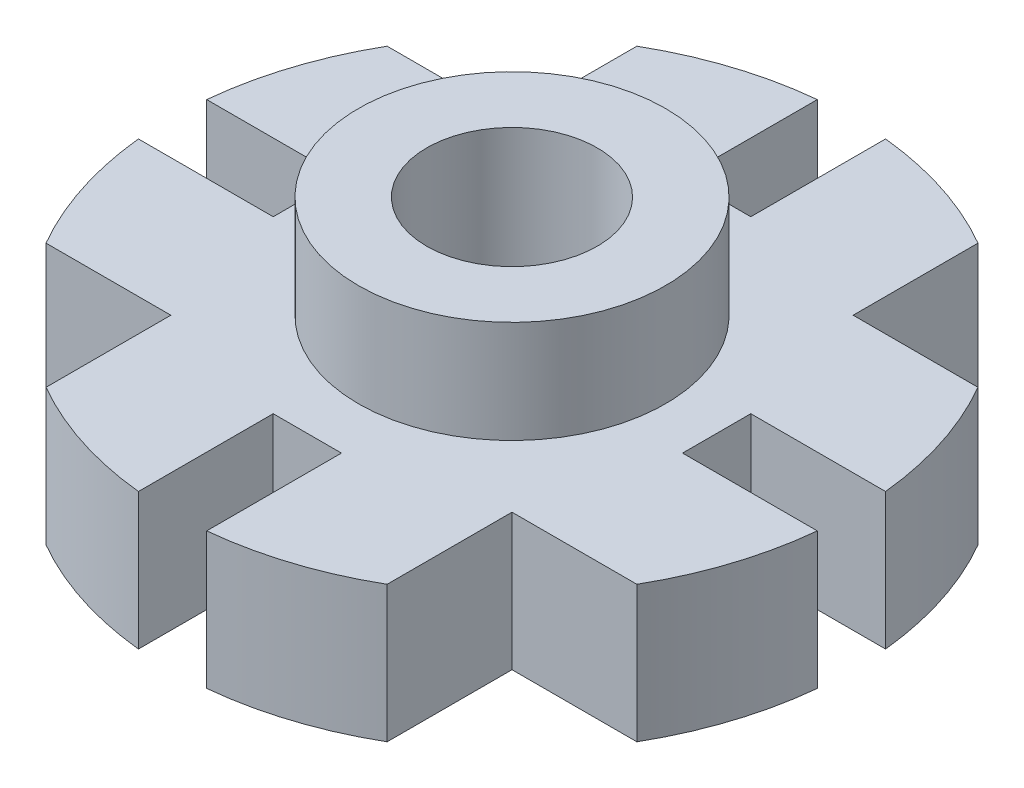
ISO-10303-21;
HEADER;
FILE_DESCRIPTION(('STEP AP214'),'2;1');
FILE_NAME('part.step','',(''),(''),'','','');
FILE_SCHEMA(('AUTOMOTIVE_DESIGN { 1 0 10303 214 1 1 1 1 }'));
ENDSEC;
DATA;
#1=APPLICATION_CONTEXT('core data for automotive mechanical design processes');
#2=APPLICATION_PROTOCOL_DEFINITION('international standard','automotive_design',2000,#1);
#3=PRODUCT_CONTEXT('',#1,'mechanical');
#4=PRODUCT('Part','Part','',(#3));
#5=PRODUCT_RELATED_PRODUCT_CATEGORY('part','',(#4));
#6=PRODUCT_DEFINITION_FORMATION('','',#4);
#7=PRODUCT_DEFINITION_CONTEXT('part definition',#1,'design');
#8=PRODUCT_DEFINITION('design','',#6,#7);
#9=PRODUCT_DEFINITION_SHAPE('','',#8);
#10=(LENGTH_UNIT() NAMED_UNIT(*) SI_UNIT(.MILLI.,.METRE.));
#11=(NAMED_UNIT(*) PLANE_ANGLE_UNIT() SI_UNIT($,.RADIAN.));
#12=(NAMED_UNIT(*) SI_UNIT($,.STERADIAN.) SOLID_ANGLE_UNIT());
#13=UNCERTAINTY_MEASURE_WITH_UNIT(LENGTH_MEASURE(1.E-05),#10,'distance_accuracy_value','');
#14=(GEOMETRIC_REPRESENTATION_CONTEXT(3) GLOBAL_UNCERTAINTY_ASSIGNED_CONTEXT((#13)) GLOBAL_UNIT_ASSIGNED_CONTEXT((#10,
#11,#12)) REPRESENTATION_CONTEXT('',''));
#15=CARTESIAN_POINT('',(0.,0.,0.));
#16=DIRECTION('',(0.,0.,1.));
#17=DIRECTION('',(1.,0.,0.));
#18=AXIS2_PLACEMENT_3D('',#15,#16,#17);
#19=CARTESIAN_POINT('',(0.,-25.4,0.));
#20=DIRECTION('',(0.,1.,0.));
#21=DIRECTION('',(0.,0.,1.));
#22=AXIS2_PLACEMENT_3D('',#19,#20,#21);
#23=CYLINDRICAL_SURFACE('',#22,63.5);
#24=DIRECTION('',(0.,1.,0.));
#25=VECTOR('',#24,1.);
#26=CARTESIAN_POINT('',(-31.749999999999,-25.4,-54.9926131403124));
#27=LINE('',#26,#25);
#28=CARTESIAN_POINT('',(-31.749999999999,0.,-54.9926131403124));
#29=VERTEX_POINT('',#28);
#30=CARTESIAN_POINT('',(-31.749999999999,-25.4,-54.9926131403124));
#31=VERTEX_POINT('',#30);
#32=EDGE_CURVE('E280',#29,#31,#27,.F.);
#33=ORIENTED_EDGE('',*,*,#32,.F.);
#34=CARTESIAN_POINT('',(0.,0.,0.));
#35=DIRECTION('',(0.,1.,0.));
#36=DIRECTION('',(0.,0.,1.));
#37=AXIS2_PLACEMENT_3D('',#34,#35,#36);
#38=CIRCLE('',#37,63.5);
#39=CARTESIAN_POINT('',(-6.35000000000002,0.,-63.1817022562704));
#40=VERTEX_POINT('',#39);
#41=EDGE_CURVE('E440',#40,#29,#38,.T.);
#42=ORIENTED_EDGE('',*,*,#41,.F.);
#43=DIRECTION('',(0.,1.,0.));
#44=VECTOR('',#43,1.);
#45=CARTESIAN_POINT('',(-6.35000000000002,-25.4,-63.1817022562704));
#46=LINE('',#45,#44);
#47=CARTESIAN_POINT('',(-6.35000000000002,-25.4,-63.1817022562704));
#48=VERTEX_POINT('',#47);
#49=EDGE_CURVE('E387',#48,#40,#46,.T.);
#50=ORIENTED_EDGE('',*,*,#49,.F.);
#51=CARTESIAN_POINT('',(0.,-25.4,0.));
#52=DIRECTION('',(0.,1.,0.));
#53=DIRECTION('',(0.,0.,1.));
#54=AXIS2_PLACEMENT_3D('',#51,#52,#53);
#55=CIRCLE('',#54,63.5);
#56=EDGE_CURVE('E470',#48,#31,#55,.T.);
#57=ORIENTED_EDGE('',*,*,#56,.T.);
#58=EDGE_LOOP('',(#33,#42,#50,#57));
#59=FACE_BOUND('',#58,.T.);
#60=ADVANCED_FACE('F33',(#59),#23,.T.);
#61=DIRECTION('',(0.,1.,0.));
#62=VECTOR('',#61,1.);
#63=CARTESIAN_POINT('',(31.7499999999999,-25.4,54.9926131403119));
#64=LINE('',#63,#62);
#65=CARTESIAN_POINT('',(31.7499999999999,0.,54.9926131403119));
#66=VERTEX_POINT('',#65);
#67=CARTESIAN_POINT('',(31.7499999999999,-25.4,54.9926131403119));
#68=VERTEX_POINT('',#67);
#69=EDGE_CURVE('E285',#66,#68,#64,.F.);
#70=ORIENTED_EDGE('',*,*,#69,.F.);
#71=CARTESIAN_POINT('',(6.35000000000005,0.,63.1817022562704));
#72=VERTEX_POINT('',#71);
#73=EDGE_CURVE('E408',#72,#66,#38,.T.);
#74=ORIENTED_EDGE('',*,*,#73,.F.);
#75=DIRECTION('',(0.,1.,0.));
#76=VECTOR('',#75,1.);
#77=CARTESIAN_POINT('',(6.35000000000005,-25.4,63.1817022562704));
#78=LINE('',#77,#76);
#79=CARTESIAN_POINT('',(6.35000000000005,-25.4,63.1817022562704));
#80=VERTEX_POINT('',#79);
#81=EDGE_CURVE('E374',#80,#72,#78,.T.);
#82=ORIENTED_EDGE('',*,*,#81,.F.);
#83=EDGE_CURVE('E397',#80,#68,#55,.T.);
#84=ORIENTED_EDGE('',*,*,#83,.T.);
#85=EDGE_LOOP('',(#70,#74,#82,#84));
#86=FACE_BOUND('',#85,.T.);
#87=ADVANCED_FACE('F468',(#86),#23,.T.);
#88=DIRECTION('',(0.,1.,0.));
#89=VECTOR('',#88,1.);
#90=CARTESIAN_POINT('',(-54.9926131403124,-25.4,31.749999999999));
#91=LINE('',#90,#89);
#92=CARTESIAN_POINT('',(-54.9926131403124,0.,31.749999999999));
#93=VERTEX_POINT('',#92);
#94=CARTESIAN_POINT('',(-54.9926131403124,-25.4,31.749999999999));
#95=VERTEX_POINT('',#94);
#96=EDGE_CURVE('E289',#93,#95,#91,.F.);
#97=ORIENTED_EDGE('',*,*,#96,.F.);
#98=CARTESIAN_POINT('',(-63.1817022562704,0.,6.35000000000006));
#99=VERTEX_POINT('',#98);
#100=EDGE_CURVE('E403',#99,#93,#38,.T.);
#101=ORIENTED_EDGE('',*,*,#100,.F.);
#102=DIRECTION('',(0.,1.,0.));
#103=VECTOR('',#102,1.);
#104=CARTESIAN_POINT('',(-63.1817022562704,-25.4,6.35000000000006));
#105=LINE('',#104,#103);
#106=CARTESIAN_POINT('',(-63.1817022562704,-25.4,6.35000000000006));
#107=VERTEX_POINT('',#106);
#108=EDGE_CURVE('E310',#107,#99,#105,.T.);
#109=ORIENTED_EDGE('',*,*,#108,.F.);
#110=EDGE_CURVE('E398',#107,#95,#55,.T.);
#111=ORIENTED_EDGE('',*,*,#110,.T.);
#112=EDGE_LOOP('',(#97,#101,#109,#111));
#113=FACE_BOUND('',#112,.T.);
#114=ADVANCED_FACE('F497',(#113),#23,.T.);
#115=DIRECTION('',(0.,1.,0.));
#116=VECTOR('',#115,1.);
#117=CARTESIAN_POINT('',(54.992613140312,-25.4,-31.7499999999998));
#118=LINE('',#117,#116);
#119=CARTESIAN_POINT('',(54.992613140312,0.,-31.7499999999998));
#120=VERTEX_POINT('',#119);
#121=CARTESIAN_POINT('',(54.992613140312,-25.4,-31.7499999999998));
#122=VERTEX_POINT('',#121);
#123=EDGE_CURVE('E229',#120,#122,#118,.F.);
#124=ORIENTED_EDGE('',*,*,#123,.F.);
#125=CARTESIAN_POINT('',(63.1817022562704,0.,-6.35000000000002));
#126=VERTEX_POINT('',#125);
#127=EDGE_CURVE('E437',#126,#120,#38,.T.);
#128=ORIENTED_EDGE('',*,*,#127,.F.);
#129=DIRECTION('',(0.,1.,0.));
#130=VECTOR('',#129,1.);
#131=CARTESIAN_POINT('',(63.1817022562704,-25.4,-6.35000000000002));
#132=LINE('',#131,#130);
#133=CARTESIAN_POINT('',(63.1817022562704,-25.4,-6.35000000000002));
#134=VERTEX_POINT('',#133);
#135=EDGE_CURVE('E379',#134,#126,#132,.T.);
#136=ORIENTED_EDGE('',*,*,#135,.F.);
#137=EDGE_CURVE('E469',#134,#122,#55,.T.);
#138=ORIENTED_EDGE('',*,*,#137,.T.);
#139=EDGE_LOOP('',(#124,#128,#136,#138));
#140=FACE_BOUND('',#139,.T.);
#141=ADVANCED_FACE('F736',(#140),#23,.T.);
#142=DIRECTION('',(0.,1.,0.));
#143=VECTOR('',#142,1.);
#144=CARTESIAN_POINT('',(-54.9926131403115,-25.4,-31.7500000000005));
#145=LINE('',#144,#143);
#146=CARTESIAN_POINT('',(-54.9926131403115,-25.4,-31.7500000000005));
#147=VERTEX_POINT('',#146);
#148=CARTESIAN_POINT('',(-54.9926131403115,0.,-31.7500000000005));
#149=VERTEX_POINT('',#148);
#150=EDGE_CURVE('E278',#147,#149,#145,.T.);
#151=ORIENTED_EDGE('',*,*,#150,.F.);
#152=CARTESIAN_POINT('',(-63.1817022562704,-25.4,-6.34999999999998));
#153=VERTEX_POINT('',#152);
#154=EDGE_CURVE('E401',#147,#153,#55,.T.);
#155=ORIENTED_EDGE('',*,*,#154,.T.);
#156=DIRECTION('',(0.,1.,0.));
#157=VECTOR('',#156,1.);
#158=CARTESIAN_POINT('',(-63.1817022562704,-25.4,-6.34999999999998));
#159=LINE('',#158,#157);
#160=CARTESIAN_POINT('',(-63.1817022562704,0.,-6.34999999999998));
#161=VERTEX_POINT('',#160);
#162=EDGE_CURVE('E371',#161,#153,#159,.F.);
#163=ORIENTED_EDGE('',*,*,#162,.F.);
#164=EDGE_CURVE('E406',#149,#161,#38,.T.);
#165=ORIENTED_EDGE('',*,*,#164,.F.);
#166=EDGE_LOOP('',(#151,#155,#163,#165));
#167=FACE_BOUND('',#166,.T.);
#168=ADVANCED_FACE('F482',(#167),#23,.T.);
#169=DIRECTION('',(0.,1.,0.));
#170=VECTOR('',#169,1.);
#171=CARTESIAN_POINT('',(54.9926131403117,-25.4,31.7500000000002));
#172=LINE('',#171,#170);
#173=CARTESIAN_POINT('',(54.9926131403117,-25.4,31.7500000000002));
#174=VERTEX_POINT('',#173);
#175=CARTESIAN_POINT('',(54.9926131403117,0.,31.7500000000002));
#176=VERTEX_POINT('',#175);
#177=EDGE_CURVE('E56',#174,#176,#172,.T.);
#178=ORIENTED_EDGE('',*,*,#177,.F.);
#179=CARTESIAN_POINT('',(63.1817022562704,-25.4,6.35000000000002));
#180=VERTEX_POINT('',#179);
#181=EDGE_CURVE('E438',#174,#180,#55,.T.);
#182=ORIENTED_EDGE('',*,*,#181,.T.);
#183=DIRECTION('',(0.,1.,0.));
#184=VECTOR('',#183,1.);
#185=CARTESIAN_POINT('',(63.1817022562704,-25.4,6.35000000000002));
#186=LINE('',#185,#184);
#187=CARTESIAN_POINT('',(63.1817022562704,0.,6.35000000000002));
#188=VERTEX_POINT('',#187);
#189=EDGE_CURVE('E381',#188,#180,#186,.F.);
#190=ORIENTED_EDGE('',*,*,#189,.F.);
#191=EDGE_CURVE('E436',#176,#188,#38,.T.);
#192=ORIENTED_EDGE('',*,*,#191,.F.);
#193=EDGE_LOOP('',(#178,#182,#190,#192));
#194=FACE_BOUND('',#193,.T.);
#195=ADVANCED_FACE('F526',(#194),#23,.T.);
#196=DIRECTION('',(0.,1.,0.));
#197=VECTOR('',#196,1.);
#198=CARTESIAN_POINT('',(-31.7500000000002,-25.4,54.9926131403117));
#199=LINE('',#198,#197);
#200=CARTESIAN_POINT('',(-31.7500000000002,-25.4,54.9926131403117));
#201=VERTEX_POINT('',#200);
#202=CARTESIAN_POINT('',(-31.7500000000002,0.,54.9926131403117));
#203=VERTEX_POINT('',#202);
#204=EDGE_CURVE('E287',#201,#203,#199,.T.);
#205=ORIENTED_EDGE('',*,*,#204,.F.);
#206=CARTESIAN_POINT('',(-6.34999999999999,-25.4,63.1817022562704));
#207=VERTEX_POINT('',#206);
#208=EDGE_CURVE('E402',#201,#207,#55,.T.);
#209=ORIENTED_EDGE('',*,*,#208,.T.);
#210=DIRECTION('',(0.,1.,0.));
#211=VECTOR('',#210,1.);
#212=CARTESIAN_POINT('',(-6.34999999999999,-25.4,63.1817022562704));
#213=LINE('',#212,#211);
#214=CARTESIAN_POINT('',(-6.34999999999999,0.,63.1817022562704));
#215=VERTEX_POINT('',#214);
#216=EDGE_CURVE('E376',#215,#207,#213,.F.);
#217=ORIENTED_EDGE('',*,*,#216,.F.);
#218=EDGE_CURVE('E392',#203,#215,#38,.T.);
#219=ORIENTED_EDGE('',*,*,#218,.F.);
#220=EDGE_LOOP('',(#205,#209,#217,#219));
#221=FACE_BOUND('',#220,.T.);
#222=ADVANCED_FACE('F459',(#221),#23,.T.);
#223=DIRECTION('',(0.,1.,0.));
#224=VECTOR('',#223,1.);
#225=CARTESIAN_POINT('',(31.7500000000002,-25.4,-54.9926131403118));
#226=LINE('',#225,#224);
#227=CARTESIAN_POINT('',(31.7500000000002,-25.4,-54.9926131403118));
#228=VERTEX_POINT('',#227);
#229=CARTESIAN_POINT('',(31.7500000000002,0.,-54.9926131403118));
#230=VERTEX_POINT('',#229);
#231=EDGE_CURVE('E48',#228,#230,#226,.T.);
#232=ORIENTED_EDGE('',*,*,#231,.F.);
#233=CARTESIAN_POINT('',(6.35000000000002,-25.4,-63.1817022562704));
#234=VERTEX_POINT('',#233);
#235=EDGE_CURVE('E238',#228,#234,#55,.T.);
#236=ORIENTED_EDGE('',*,*,#235,.T.);
#237=DIRECTION('',(0.,1.,0.));
#238=VECTOR('',#237,1.);
#239=CARTESIAN_POINT('',(6.35000000000002,-25.4,-63.1817022562704));
#240=LINE('',#239,#238);
#241=CARTESIAN_POINT('',(6.35000000000002,0.,-63.1817022562704));
#242=VERTEX_POINT('',#241);
#243=EDGE_CURVE('E384',#242,#234,#240,.F.);
#244=ORIENTED_EDGE('',*,*,#243,.F.);
#245=EDGE_CURVE('E407',#230,#242,#38,.T.);
#246=ORIENTED_EDGE('',*,*,#245,.F.);
#247=EDGE_LOOP('',(#232,#236,#244,#246));
#248=FACE_BOUND('',#247,.T.);
#249=ADVANCED_FACE('F35',(#248),#23,.T.);
#250=CARTESIAN_POINT('',(0.,-25.4,0.));
#251=DIRECTION('',(0.,1.,0.));
#252=DIRECTION('',(0.,0.,1.));
#253=AXIS2_PLACEMENT_3D('',#250,#251,#252);
#254=PLANE('',#253);
#255=CARTESIAN_POINT('',(0.,-25.4,0.));
#256=DIRECTION('',(0.,1.,0.));
#257=DIRECTION('',(0.,0.,1.));
#258=AXIS2_PLACEMENT_3D('',#255,#256,#257);
#259=CIRCLE('',#258,15.875);
#260=CARTESIAN_POINT('',(0.,-25.4,15.875));
#261=VERTEX_POINT('',#260);
#262=EDGE_CURVE('E265',#261,#261,#259,.T.);
#263=ORIENTED_EDGE('',*,*,#262,.T.);
#264=EDGE_LOOP('',(#263));
#265=FACE_BOUND('',#264,.T.);
#266=DIRECTION('',(0.,0.,-1.));
#267=VECTOR('',#266,1.);
#268=CARTESIAN_POINT('',(-31.7500000000003,-25.4,57.1499999999989));
#269=LINE('',#268,#267);
#270=CARTESIAN_POINT('',(-31.7499999999991,-25.4,31.75));
#271=VERTEX_POINT('',#270);
#272=EDGE_CURVE('E258',#201,#271,#269,.T.);
#273=ORIENTED_EDGE('',*,*,#272,.T.);
#274=DIRECTION('',(-1.,0.,0.));
#275=VECTOR('',#274,1.);
#276=CARTESIAN_POINT('',(-57.1500000000003,-25.4,31.7499999999989));
#277=LINE('',#276,#275);
#278=EDGE_CURVE('E260',#271,#95,#277,.T.);
#279=ORIENTED_EDGE('',*,*,#278,.T.);
#280=ORIENTED_EDGE('',*,*,#110,.F.);
#281=DIRECTION('',(1.,0.,0.));
#282=VECTOR('',#281,1.);
#283=CARTESIAN_POINT('',(-63.5,-25.4,6.35000000000006));
#284=LINE('',#283,#282);
#285=CARTESIAN_POINT('',(-38.1,-25.4,6.35000000000004));
#286=VERTEX_POINT('',#285);
#287=EDGE_CURVE('E352',#107,#286,#284,.T.);
#288=ORIENTED_EDGE('',*,*,#287,.T.);
#289=DIRECTION('',(0.,0.,-1.));
#290=VECTOR('',#289,1.);
#291=CARTESIAN_POINT('',(-38.1,-25.4,6.35000000000004));
#292=LINE('',#291,#290);
#293=CARTESIAN_POINT('',(-38.1,-25.4,-6.34999999999997));
#294=VERTEX_POINT('',#293);
#295=EDGE_CURVE('E355',#286,#294,#292,.T.);
#296=ORIENTED_EDGE('',*,*,#295,.T.);
#297=DIRECTION('',(-1.,0.,0.));
#298=VECTOR('',#297,1.);
#299=CARTESIAN_POINT('',(-63.5,-25.4,-6.34999999999998));
#300=LINE('',#299,#298);
#301=EDGE_CURVE('E359',#294,#153,#300,.T.);
#302=ORIENTED_EDGE('',*,*,#301,.T.);
#303=ORIENTED_EDGE('',*,*,#154,.F.);
#304=DIRECTION('',(1.,0.,0.));
#305=VECTOR('',#304,1.);
#306=CARTESIAN_POINT('',(-57.1499999999989,-25.4,-31.7500000000006));
#307=LINE('',#306,#305);
#308=CARTESIAN_POINT('',(-31.75,-25.4,-31.75));
#309=VERTEX_POINT('',#308);
#310=EDGE_CURVE('E268',#147,#309,#307,.T.);
#311=ORIENTED_EDGE('',*,*,#310,.T.);
#312=DIRECTION('',(0.,0.,-1.));
#313=VECTOR('',#312,1.);
#314=CARTESIAN_POINT('',(-31.7499999999989,-25.4,-57.1500000000012));
#315=LINE('',#314,#313);
#316=EDGE_CURVE('E271',#309,#31,#315,.T.);
#317=ORIENTED_EDGE('',*,*,#316,.T.);
#318=ORIENTED_EDGE('',*,*,#56,.F.);
#319=DIRECTION('',(0.,0.,1.));
#320=VECTOR('',#319,1.);
#321=CARTESIAN_POINT('',(-6.35000000000002,-25.4,-63.5));
#322=LINE('',#321,#320);
#323=CARTESIAN_POINT('',(-6.35,-25.4,-38.1));
#324=VERTEX_POINT('',#323);
#325=EDGE_CURVE('E292',#48,#324,#322,.T.);
#326=ORIENTED_EDGE('',*,*,#325,.T.);
#327=DIRECTION('',(1.,0.,0.));
#328=VECTOR('',#327,1.);
#329=CARTESIAN_POINT('',(-6.35,-25.4,-38.1));
#330=LINE('',#329,#328);
#331=CARTESIAN_POINT('',(6.35,-25.4,-38.1));
#332=VERTEX_POINT('',#331);
#333=EDGE_CURVE('E295',#324,#332,#330,.T.);
#334=ORIENTED_EDGE('',*,*,#333,.T.);
#335=DIRECTION('',(0.,0.,-1.));
#336=VECTOR('',#335,1.);
#337=CARTESIAN_POINT('',(6.35000000000002,-25.4,-63.5));
#338=LINE('',#337,#336);
#339=EDGE_CURVE('E299',#332,#234,#338,.T.);
#340=ORIENTED_EDGE('',*,*,#339,.T.);
#341=ORIENTED_EDGE('',*,*,#235,.F.);
#342=DIRECTION('',(0.,0.,1.));
#343=VECTOR('',#342,1.);
#344=CARTESIAN_POINT('',(31.7500000000002,-25.4,-57.1499999999999));
#345=LINE('',#344,#343);
#346=CARTESIAN_POINT('',(31.7500000000001,-25.4,-31.7499999999999));
#347=VERTEX_POINT('',#346);
#348=EDGE_CURVE('E219',#228,#347,#345,.T.);
#349=ORIENTED_EDGE('',*,*,#348,.T.);
#350=DIRECTION('',(1.,0.,0.));
#351=VECTOR('',#350,1.);
#352=CARTESIAN_POINT('',(57.1500000000001,-25.4,-31.7499999999998));
#353=LINE('',#352,#351);
#354=EDGE_CURVE('E224',#347,#122,#353,.T.);
#355=ORIENTED_EDGE('',*,*,#354,.T.);
#356=ORIENTED_EDGE('',*,*,#137,.F.);
#357=DIRECTION('',(-1.,0.,0.));
#358=VECTOR('',#357,1.);
#359=CARTESIAN_POINT('',(63.5,-25.4,-6.35000000000002));
#360=LINE('',#359,#358);
#361=CARTESIAN_POINT('',(38.1,-25.4,-6.35));
#362=VERTEX_POINT('',#361);
#363=EDGE_CURVE('E312',#134,#362,#360,.T.);
#364=ORIENTED_EDGE('',*,*,#363,.T.);
#365=DIRECTION('',(0.,0.,1.));
#366=VECTOR('',#365,1.);
#367=CARTESIAN_POINT('',(38.1,-25.4,-6.35));
#368=LINE('',#367,#366);
#369=CARTESIAN_POINT('',(38.1,-25.4,6.35));
#370=VERTEX_POINT('',#369);
#371=EDGE_CURVE('E315',#362,#370,#368,.T.);
#372=ORIENTED_EDGE('',*,*,#371,.T.);
#373=DIRECTION('',(1.,0.,0.));
#374=VECTOR('',#373,1.);
#375=CARTESIAN_POINT('',(63.5,-25.4,6.35000000000002));
#376=LINE('',#375,#374);
#377=EDGE_CURVE('E319',#370,#180,#376,.T.);
#378=ORIENTED_EDGE('',*,*,#377,.T.);
#379=ORIENTED_EDGE('',*,*,#181,.F.);
#380=DIRECTION('',(-1.,0.,0.));
#381=VECTOR('',#380,1.);
#382=CARTESIAN_POINT('',(57.1499999999998,-25.4,31.7500000000003));
#383=LINE('',#382,#381);
#384=CARTESIAN_POINT('',(31.7500000000009,-25.4,31.7499999999991));
#385=VERTEX_POINT('',#384);
#386=EDGE_CURVE('E247',#174,#385,#383,.T.);
#387=ORIENTED_EDGE('',*,*,#386,.T.);
#388=DIRECTION('',(0.,0.,1.));
#389=VECTOR('',#388,1.);
#390=CARTESIAN_POINT('',(31.7499999999998,-25.4,57.1500000000003));
#391=LINE('',#390,#389);
#392=EDGE_CURVE('E250',#385,#68,#391,.T.);
#393=ORIENTED_EDGE('',*,*,#392,.T.);
#394=ORIENTED_EDGE('',*,*,#83,.F.);
#395=DIRECTION('',(0.,0.,-1.));
#396=VECTOR('',#395,1.);
#397=CARTESIAN_POINT('',(6.35000000000005,-25.4,63.5));
#398=LINE('',#397,#396);
#399=CARTESIAN_POINT('',(6.35000000000003,-25.4,38.1));
#400=VERTEX_POINT('',#399);
#401=EDGE_CURVE('E332',#80,#400,#398,.T.);
#402=ORIENTED_EDGE('',*,*,#401,.T.);
#403=DIRECTION('',(-1.,0.,0.));
#404=VECTOR('',#403,1.);
#405=CARTESIAN_POINT('',(6.35000000000003,-25.4,38.1));
#406=LINE('',#405,#404);
#407=CARTESIAN_POINT('',(-6.34999999999998,-25.4,38.1));
#408=VERTEX_POINT('',#407);
#409=EDGE_CURVE('E335',#400,#408,#406,.T.);
#410=ORIENTED_EDGE('',*,*,#409,.T.);
#411=DIRECTION('',(0.,0.,1.));
#412=VECTOR('',#411,1.);
#413=CARTESIAN_POINT('',(-6.34999999999999,-25.4,63.5));
#414=LINE('',#413,#412);
#415=EDGE_CURVE('E339',#408,#207,#414,.T.);
#416=ORIENTED_EDGE('',*,*,#415,.T.);
#417=ORIENTED_EDGE('',*,*,#208,.F.);
#418=EDGE_LOOP('',(#273,#279,#280,#288,#296,#302,#303,#311,#317,#318,#326,#334,#340,#341,#349,
#355,#356,#364,#372,#378,#379,#387,#393,#394,#402,#410,#416,#417));
#419=FACE_BOUND('',#418,.T.);
#420=ADVANCED_FACE('F236',(#265,#419),#254,.F.);
#421=CARTESIAN_POINT('',(0.,0.,0.));
#422=DIRECTION('',(0.,1.,0.));
#423=DIRECTION('',(0.,0.,1.));
#424=AXIS2_PLACEMENT_3D('',#421,#422,#423);
#425=PLANE('',#424);
#426=DIRECTION('',(-1.,0.,0.));
#427=VECTOR('',#426,1.);
#428=CARTESIAN_POINT('',(-57.1500000000003,0.,31.7499999999989));
#429=LINE('',#428,#427);
#430=CARTESIAN_POINT('',(-31.7499999999991,0.,31.75));
#431=VERTEX_POINT('',#430);
#432=EDGE_CURVE('E261',#431,#93,#429,.T.);
#433=ORIENTED_EDGE('',*,*,#432,.F.);
#434=DIRECTION('',(0.,0.,-1.));
#435=VECTOR('',#434,1.);
#436=CARTESIAN_POINT('',(-31.7499999999976,0.,-1.50053580671989E-12));
#437=LINE('',#436,#435);
#438=EDGE_CURVE('E11',#203,#431,#437,.T.);
#439=ORIENTED_EDGE('',*,*,#438,.F.);
#440=ORIENTED_EDGE('',*,*,#218,.T.);
#441=DIRECTION('',(0.,0.,1.));
#442=VECTOR('',#441,1.);
#443=CARTESIAN_POINT('',(-6.34999999999999,0.,63.5));
#444=LINE('',#443,#442);
#445=CARTESIAN_POINT('',(-6.34999999999998,0.,38.1));
#446=VERTEX_POINT('',#445);
#447=EDGE_CURVE('E336',#446,#215,#444,.T.);
#448=ORIENTED_EDGE('',*,*,#447,.F.);
#449=DIRECTION('',(-1.,0.,0.));
#450=VECTOR('',#449,1.);
#451=CARTESIAN_POINT('',(6.35000000000003,0.,38.1));
#452=LINE('',#451,#450);
#453=CARTESIAN_POINT('',(6.35000000000003,0.,38.1));
#454=VERTEX_POINT('',#453);
#455=EDGE_CURVE('E343',#454,#446,#452,.T.);
#456=ORIENTED_EDGE('',*,*,#455,.F.);
#457=DIRECTION('',(0.,0.,-1.));
#458=VECTOR('',#457,1.);
#459=CARTESIAN_POINT('',(6.35,0.,0.));
#460=LINE('',#459,#458);
#461=EDGE_CURVE('E410',#72,#454,#460,.T.);
#462=ORIENTED_EDGE('',*,*,#461,.F.);
#463=ORIENTED_EDGE('',*,*,#73,.T.);
#464=DIRECTION('',(0.,0.,1.));
#465=VECTOR('',#464,1.);
#466=CARTESIAN_POINT('',(31.7499999999998,0.,57.1500000000003));
#467=LINE('',#466,#465);
#468=CARTESIAN_POINT('',(31.7500000000009,0.,31.7499999999991));
#469=VERTEX_POINT('',#468);
#470=EDGE_CURVE('E251',#469,#66,#467,.T.);
#471=ORIENTED_EDGE('',*,*,#470,.F.);
#472=DIRECTION('',(-1.,0.,0.));
#473=VECTOR('',#472,1.);
#474=CARTESIAN_POINT('',(-1.50053580671989E-12,0.,31.7499999999976));
#475=LINE('',#474,#473);
#476=EDGE_CURVE('E41',#176,#469,#475,.T.);
#477=ORIENTED_EDGE('',*,*,#476,.F.);
#478=ORIENTED_EDGE('',*,*,#191,.T.);
#479=DIRECTION('',(1.,0.,0.));
#480=VECTOR('',#479,1.);
#481=CARTESIAN_POINT('',(63.5,0.,6.35000000000002));
#482=LINE('',#481,#480);
#483=CARTESIAN_POINT('',(38.1,0.,6.35));
#484=VERTEX_POINT('',#483);
#485=EDGE_CURVE('E316',#484,#188,#482,.T.);
#486=ORIENTED_EDGE('',*,*,#485,.F.);
#487=DIRECTION('',(0.,0.,1.));
#488=VECTOR('',#487,1.);
#489=CARTESIAN_POINT('',(38.1,0.,-6.35));
#490=LINE('',#489,#488);
#491=CARTESIAN_POINT('',(38.1,0.,-6.35));
#492=VERTEX_POINT('',#491);
#493=EDGE_CURVE('E323',#492,#484,#490,.T.);
#494=ORIENTED_EDGE('',*,*,#493,.F.);
#495=DIRECTION('',(-1.,0.,0.));
#496=VECTOR('',#495,1.);
#497=CARTESIAN_POINT('',(0.,0.,-6.34999999999998));
#498=LINE('',#497,#496);
#499=EDGE_CURVE('E412',#126,#492,#498,.T.);
#500=ORIENTED_EDGE('',*,*,#499,.F.);
#501=ORIENTED_EDGE('',*,*,#127,.T.);
#502=DIRECTION('',(1.,0.,0.));
#503=VECTOR('',#502,1.);
#504=CARTESIAN_POINT('',(57.1500000000001,0.,-31.7499999999998));
#505=LINE('',#504,#503);
#506=CARTESIAN_POINT('',(31.7500000000001,0.,-31.7499999999999));
#507=VERTEX_POINT('',#506);
#508=EDGE_CURVE('E239',#507,#120,#505,.T.);
#509=ORIENTED_EDGE('',*,*,#508,.F.);
#510=DIRECTION('',(0.,0.,1.));
#511=VECTOR('',#510,1.);
#512=CARTESIAN_POINT('',(31.75,0.,1.04083408558608E-13));
#513=LINE('',#512,#511);
#514=EDGE_CURVE('E220',#230,#507,#513,.T.);
#515=ORIENTED_EDGE('',*,*,#514,.F.);
#516=ORIENTED_EDGE('',*,*,#245,.T.);
#517=DIRECTION('',(0.,0.,-1.));
#518=VECTOR('',#517,1.);
#519=CARTESIAN_POINT('',(6.35000000000002,0.,-63.5));
#520=LINE('',#519,#518);
#521=CARTESIAN_POINT('',(6.35,0.,-38.1));
#522=VERTEX_POINT('',#521);
#523=EDGE_CURVE('E296',#522,#242,#520,.T.);
#524=ORIENTED_EDGE('',*,*,#523,.F.);
#525=DIRECTION('',(1.,0.,0.));
#526=VECTOR('',#525,1.);
#527=CARTESIAN_POINT('',(-6.35,0.,-38.1));
#528=LINE('',#527,#526);
#529=CARTESIAN_POINT('',(-6.35,0.,-38.1));
#530=VERTEX_POINT('',#529);
#531=EDGE_CURVE('E302',#530,#522,#528,.T.);
#532=ORIENTED_EDGE('',*,*,#531,.F.);
#533=DIRECTION('',(0.,0.,1.));
#534=VECTOR('',#533,1.);
#535=CARTESIAN_POINT('',(-6.34999999999998,0.,0.));
#536=LINE('',#535,#534);
#537=EDGE_CURVE('E414',#40,#530,#536,.T.);
#538=ORIENTED_EDGE('',*,*,#537,.F.);
#539=ORIENTED_EDGE('',*,*,#41,.T.);
#540=DIRECTION('',(0.,0.,-1.));
#541=VECTOR('',#540,1.);
#542=CARTESIAN_POINT('',(-31.7499999999989,0.,-57.1500000000012));
#543=LINE('',#542,#541);
#544=CARTESIAN_POINT('',(-31.75,0.,-31.75));
#545=VERTEX_POINT('',#544);
#546=EDGE_CURVE('E223',#545,#29,#543,.T.);
#547=ORIENTED_EDGE('',*,*,#546,.F.);
#548=DIRECTION('',(1.,0.,0.));
#549=VECTOR('',#548,1.);
#550=CARTESIAN_POINT('',(7.45931094670042E-13,0.,-31.7499999999993));
#551=LINE('',#550,#549);
#552=EDGE_CURVE('E417',#149,#545,#551,.T.);
#553=ORIENTED_EDGE('',*,*,#552,.F.);
#554=ORIENTED_EDGE('',*,*,#164,.T.);
#555=DIRECTION('',(-1.,0.,0.));
#556=VECTOR('',#555,1.);
#557=CARTESIAN_POINT('',(-63.5,0.,-6.34999999999998));
#558=LINE('',#557,#556);
#559=CARTESIAN_POINT('',(-38.1,0.,-6.34999999999997));
#560=VERTEX_POINT('',#559);
#561=EDGE_CURVE('E356',#560,#161,#558,.T.);
#562=ORIENTED_EDGE('',*,*,#561,.F.);
#563=DIRECTION('',(0.,0.,-1.));
#564=VECTOR('',#563,1.);
#565=CARTESIAN_POINT('',(-38.1,0.,6.35000000000004));
#566=LINE('',#565,#564);
#567=CARTESIAN_POINT('',(-38.1,0.,6.35000000000004));
#568=VERTEX_POINT('',#567);
#569=EDGE_CURVE('E291',#568,#560,#566,.T.);
#570=ORIENTED_EDGE('',*,*,#569,.F.);
#571=DIRECTION('',(1.,0.,0.));
#572=VECTOR('',#571,1.);
#573=CARTESIAN_POINT('',(0.,0.,6.35000000000001));
#574=LINE('',#573,#572);
#575=EDGE_CURVE('E396',#99,#568,#574,.T.);
#576=ORIENTED_EDGE('',*,*,#575,.F.);
#577=ORIENTED_EDGE('',*,*,#100,.T.);
#578=EDGE_LOOP('',(#433,#439,#440,#448,#456,#462,#463,#471,#477,#478,#486,#494,#500,#501,#509,
#515,#516,#524,#532,#538,#539,#547,#553,#554,#562,#570,#576,#577));
#579=FACE_BOUND('',#578,.T.);
#580=CARTESIAN_POINT('',(0.,0.,0.));
#581=DIRECTION('',(0.,1.,0.));
#582=DIRECTION('',(0.,0.,1.));
#583=AXIS2_PLACEMENT_3D('',#580,#581,#582);
#584=CIRCLE('',#583,28.575);
#585=CARTESIAN_POINT('',(0.,0.,28.575));
#586=VERTEX_POINT('',#585);
#587=EDGE_CURVE('E393',#586,#586,#584,.T.);
#588=ORIENTED_EDGE('',*,*,#587,.F.);
#589=EDGE_LOOP('',(#588));
#590=FACE_BOUND('',#589,.T.);
#591=ADVANCED_FACE('F429',(#579,#590),#425,.T.);
#592=CARTESIAN_POINT('',(0.,19.05,0.));
#593=DIRECTION('',(0.,-1.,0.));
#594=DIRECTION('',(0.,0.,-1.));
#595=AXIS2_PLACEMENT_3D('',#592,#593,#594);
#596=CYLINDRICAL_SURFACE('',#595,28.575);
#597=CARTESIAN_POINT('',(0.,19.05,0.));
#598=DIRECTION('',(0.,1.,0.));
#599=DIRECTION('',(0.,0.,1.));
#600=AXIS2_PLACEMENT_3D('',#597,#598,#599);
#601=CIRCLE('',#600,28.575);
#602=CARTESIAN_POINT('',(0.,19.05,28.575));
#603=VERTEX_POINT('',#602);
#604=EDGE_CURVE('E389',#603,#603,#601,.T.);
#605=ORIENTED_EDGE('',*,*,#604,.F.);
#606=EDGE_LOOP('',(#605));
#607=FACE_BOUND('',#606,.T.);
#608=ORIENTED_EDGE('',*,*,#587,.T.);
#609=EDGE_LOOP('',(#608));
#610=FACE_BOUND('',#609,.T.);
#611=ADVANCED_FACE('F586',(#607,#610),#596,.T.);
#612=CARTESIAN_POINT('',(0.,19.05,0.));
#613=DIRECTION('',(0.,1.,0.));
#614=DIRECTION('',(0.,0.,1.));
#615=AXIS2_PLACEMENT_3D('',#612,#613,#614);
#616=PLANE('',#615);
#617=CARTESIAN_POINT('',(0.,19.05,0.));
#618=DIRECTION('',(0.,1.,0.));
#619=DIRECTION('',(0.,0.,1.));
#620=AXIS2_PLACEMENT_3D('',#617,#618,#619);
#621=CIRCLE('',#620,15.875);
#622=CARTESIAN_POINT('',(0.,19.05,15.875));
#623=VERTEX_POINT('',#622);
#624=EDGE_CURVE('E244',#623,#623,#621,.T.);
#625=ORIENTED_EDGE('',*,*,#624,.F.);
#626=EDGE_LOOP('',(#625));
#627=FACE_BOUND('',#626,.T.);
#628=ORIENTED_EDGE('',*,*,#604,.T.);
#629=EDGE_LOOP('',(#628));
#630=FACE_BOUND('',#629,.T.);
#631=ADVANCED_FACE('F579',(#627,#630),#616,.T.);
#632=CARTESIAN_POINT('',(-63.5,-25.4,-6.34999999999998));
#633=DIRECTION('',(0.,0.,-1.));
#634=DIRECTION('',(-1.,0.,0.));
#635=AXIS2_PLACEMENT_3D('',#632,#633,#634);
#636=PLANE('',#635);
#637=ORIENTED_EDGE('',*,*,#162,.T.);
#638=ORIENTED_EDGE('',*,*,#301,.F.);
#639=DIRECTION('',(0.,1.,0.));
#640=VECTOR('',#639,1.);
#641=CARTESIAN_POINT('',(-38.1,-25.4,-6.34999999999997));
#642=LINE('',#641,#640);
#643=EDGE_CURVE('E346',#294,#560,#642,.T.);
#644=ORIENTED_EDGE('',*,*,#643,.T.);
#645=ORIENTED_EDGE('',*,*,#561,.T.);
#646=EDGE_LOOP('',(#637,#638,#644,#645));
#647=FACE_BOUND('',#646,.T.);
#648=ADVANCED_FACE('F485',(#647),#636,.F.);
#649=CARTESIAN_POINT('',(-38.1,-25.4,6.35000000000004));
#650=DIRECTION('',(1.,0.,0.));
#651=DIRECTION('',(0.,0.,-1.));
#652=AXIS2_PLACEMENT_3D('',#649,#650,#651);
#653=PLANE('',#652);
#654=ORIENTED_EDGE('',*,*,#569,.T.);
#655=ORIENTED_EDGE('',*,*,#643,.F.);
#656=ORIENTED_EDGE('',*,*,#295,.F.);
#657=DIRECTION('',(0.,1.,0.));
#658=VECTOR('',#657,1.);
#659=CARTESIAN_POINT('',(-38.1,-25.4,6.35000000000004));
#660=LINE('',#659,#658);
#661=EDGE_CURVE('E362',#286,#568,#660,.T.);
#662=ORIENTED_EDGE('',*,*,#661,.T.);
#663=EDGE_LOOP('',(#654,#655,#656,#662));
#664=FACE_BOUND('',#663,.T.);
#665=ADVANCED_FACE('F489',(#664),#653,.F.);
#666=CARTESIAN_POINT('',(-63.5,-25.4,6.35000000000006));
#667=DIRECTION('',(0.,0.,1.));
#668=DIRECTION('',(1.,0.,0.));
#669=AXIS2_PLACEMENT_3D('',#666,#667,#668);
#670=PLANE('',#669);
#671=ORIENTED_EDGE('',*,*,#108,.T.);
#672=ORIENTED_EDGE('',*,*,#575,.T.);
#673=ORIENTED_EDGE('',*,*,#661,.F.);
#674=ORIENTED_EDGE('',*,*,#287,.F.);
#675=EDGE_LOOP('',(#671,#672,#673,#674));
#676=FACE_BOUND('',#675,.T.);
#677=ADVANCED_FACE('F572',(#676),#670,.F.);
#678=CARTESIAN_POINT('',(-6.34999999999999,-25.4,63.5));
#679=DIRECTION('',(-1.,0.,0.));
#680=DIRECTION('',(0.,0.,1.));
#681=AXIS2_PLACEMENT_3D('',#678,#679,#680);
#682=PLANE('',#681);
#683=ORIENTED_EDGE('',*,*,#216,.T.);
#684=ORIENTED_EDGE('',*,*,#415,.F.);
#685=DIRECTION('',(0.,1.,0.));
#686=VECTOR('',#685,1.);
#687=CARTESIAN_POINT('',(-6.34999999999998,-25.4,38.1));
#688=LINE('',#687,#686);
#689=EDGE_CURVE('E326',#408,#446,#688,.T.);
#690=ORIENTED_EDGE('',*,*,#689,.T.);
#691=ORIENTED_EDGE('',*,*,#447,.T.);
#692=EDGE_LOOP('',(#683,#684,#690,#691));
#693=FACE_BOUND('',#692,.T.);
#694=ADVANCED_FACE('F457',(#693),#682,.F.);
#695=CARTESIAN_POINT('',(6.35000000000003,-25.4,38.1));
#696=DIRECTION('',(0.,0.,-1.));
#697=DIRECTION('',(-1.,0.,0.));
#698=AXIS2_PLACEMENT_3D('',#695,#696,#697);
#699=PLANE('',#698);
#700=ORIENTED_EDGE('',*,*,#455,.T.);
#701=ORIENTED_EDGE('',*,*,#689,.F.);
#702=ORIENTED_EDGE('',*,*,#409,.F.);
#703=DIRECTION('',(0.,1.,0.));
#704=VECTOR('',#703,1.);
#705=CARTESIAN_POINT('',(6.35000000000003,-25.4,38.1));
#706=LINE('',#705,#704);
#707=EDGE_CURVE('E342',#400,#454,#706,.T.);
#708=ORIENTED_EDGE('',*,*,#707,.T.);
#709=EDGE_LOOP('',(#700,#701,#702,#708));
#710=FACE_BOUND('',#709,.T.);
#711=ADVANCED_FACE('F464',(#710),#699,.F.);
#712=CARTESIAN_POINT('',(6.35000000000005,-25.4,63.5));
#713=DIRECTION('',(1.,0.,0.));
#714=DIRECTION('',(0.,0.,-1.));
#715=AXIS2_PLACEMENT_3D('',#712,#713,#714);
#716=PLANE('',#715);
#717=ORIENTED_EDGE('',*,*,#81,.T.);
#718=ORIENTED_EDGE('',*,*,#461,.T.);
#719=ORIENTED_EDGE('',*,*,#707,.F.);
#720=ORIENTED_EDGE('',*,*,#401,.F.);
#721=EDGE_LOOP('',(#717,#718,#719,#720));
#722=FACE_BOUND('',#721,.T.);
#723=ADVANCED_FACE('F466',(#722),#716,.F.);
#724=CARTESIAN_POINT('',(63.5,-25.4,6.35000000000002));
#725=DIRECTION('',(0.,0.,1.));
#726=DIRECTION('',(1.,0.,0.));
#727=AXIS2_PLACEMENT_3D('',#724,#725,#726);
#728=PLANE('',#727);
#729=ORIENTED_EDGE('',*,*,#189,.T.);
#730=ORIENTED_EDGE('',*,*,#377,.F.);
#731=DIRECTION('',(0.,1.,0.));
#732=VECTOR('',#731,1.);
#733=CARTESIAN_POINT('',(38.1,-25.4,6.35));
#734=LINE('',#733,#732);
#735=EDGE_CURVE('E305',#370,#484,#734,.T.);
#736=ORIENTED_EDGE('',*,*,#735,.T.);
#737=ORIENTED_EDGE('',*,*,#485,.T.);
#738=EDGE_LOOP('',(#729,#730,#736,#737));
#739=FACE_BOUND('',#738,.T.);
#740=ADVANCED_FACE('F559',(#739),#728,.F.);
#741=CARTESIAN_POINT('',(38.1,-25.4,-6.35));
#742=DIRECTION('',(-1.,0.,0.));
#743=DIRECTION('',(0.,0.,1.));
#744=AXIS2_PLACEMENT_3D('',#741,#742,#743);
#745=PLANE('',#744);
#746=ORIENTED_EDGE('',*,*,#493,.T.);
#747=ORIENTED_EDGE('',*,*,#735,.F.);
#748=ORIENTED_EDGE('',*,*,#371,.F.);
#749=DIRECTION('',(0.,1.,0.));
#750=VECTOR('',#749,1.);
#751=CARTESIAN_POINT('',(38.1,-25.4,-6.35));
#752=LINE('',#751,#750);
#753=EDGE_CURVE('E322',#362,#492,#752,.T.);
#754=ORIENTED_EDGE('',*,*,#753,.T.);
#755=EDGE_LOOP('',(#746,#747,#748,#754));
#756=FACE_BOUND('',#755,.T.);
#757=ADVANCED_FACE('F562',(#756),#745,.F.);
#758=CARTESIAN_POINT('',(63.5,-25.4,-6.35000000000002));
#759=DIRECTION('',(0.,0.,-1.));
#760=DIRECTION('',(-1.,0.,0.));
#761=AXIS2_PLACEMENT_3D('',#758,#759,#760);
#762=PLANE('',#761);
#763=ORIENTED_EDGE('',*,*,#135,.T.);
#764=ORIENTED_EDGE('',*,*,#499,.T.);
#765=ORIENTED_EDGE('',*,*,#753,.F.);
#766=ORIENTED_EDGE('',*,*,#363,.F.);
#767=EDGE_LOOP('',(#763,#764,#765,#766));
#768=FACE_BOUND('',#767,.T.);
#769=ADVANCED_FACE('F558',(#768),#762,.F.);
#770=CARTESIAN_POINT('',(-6.35000000000002,-25.4,-63.5));
#771=DIRECTION('',(-1.,0.,0.));
#772=DIRECTION('',(0.,0.,1.));
#773=AXIS2_PLACEMENT_3D('',#770,#771,#772);
#774=PLANE('',#773);
#775=ORIENTED_EDGE('',*,*,#49,.T.);
#776=ORIENTED_EDGE('',*,*,#537,.T.);
#777=DIRECTION('',(0.,1.,0.));
#778=VECTOR('',#777,1.);
#779=CARTESIAN_POINT('',(-6.35,-25.4,-38.1));
#780=LINE('',#779,#778);
#781=EDGE_CURVE('E301',#324,#530,#780,.T.);
#782=ORIENTED_EDGE('',*,*,#781,.F.);
#783=ORIENTED_EDGE('',*,*,#325,.F.);
#784=EDGE_LOOP('',(#775,#776,#782,#783));
#785=FACE_BOUND('',#784,.T.);
#786=ADVANCED_FACE('F553',(#785),#774,.F.);
#787=CARTESIAN_POINT('',(6.35000000000002,-25.4,-63.5));
#788=DIRECTION('',(1.,0.,0.));
#789=DIRECTION('',(0.,0.,-1.));
#790=AXIS2_PLACEMENT_3D('',#787,#788,#789);
#791=PLANE('',#790);
#792=ORIENTED_EDGE('',*,*,#243,.T.);
#793=ORIENTED_EDGE('',*,*,#339,.F.);
#794=DIRECTION('',(0.,1.,0.));
#795=VECTOR('',#794,1.);
#796=CARTESIAN_POINT('',(6.35,-25.4,-38.1));
#797=LINE('',#796,#795);
#798=EDGE_CURVE('E308',#332,#522,#797,.T.);
#799=ORIENTED_EDGE('',*,*,#798,.T.);
#800=ORIENTED_EDGE('',*,*,#523,.T.);
#801=EDGE_LOOP('',(#792,#793,#799,#800));
#802=FACE_BOUND('',#801,.T.);
#803=ADVANCED_FACE('F532',(#802),#791,.F.);
#804=CARTESIAN_POINT('',(-6.35,-25.4,-38.1));
#805=DIRECTION('',(0.,0.,1.));
#806=DIRECTION('',(1.,0.,0.));
#807=AXIS2_PLACEMENT_3D('',#804,#805,#806);
#808=PLANE('',#807);
#809=ORIENTED_EDGE('',*,*,#531,.T.);
#810=ORIENTED_EDGE('',*,*,#798,.F.);
#811=ORIENTED_EDGE('',*,*,#333,.F.);
#812=ORIENTED_EDGE('',*,*,#781,.T.);
#813=EDGE_LOOP('',(#809,#810,#811,#812));
#814=FACE_BOUND('',#813,.T.);
#815=ADVANCED_FACE('F536',(#814),#808,.F.);
#816=CARTESIAN_POINT('',(-31.7499999999989,-25.4,-57.1500000000012));
#817=DIRECTION('',(1.,0.,0.));
#818=DIRECTION('',(0.,0.,-1.));
#819=AXIS2_PLACEMENT_3D('',#816,#817,#818);
#820=PLANE('',#819);
#821=ORIENTED_EDGE('',*,*,#32,.T.);
#822=ORIENTED_EDGE('',*,*,#316,.F.);
#823=DIRECTION('',(0.,1.,0.));
#824=VECTOR('',#823,1.);
#825=CARTESIAN_POINT('',(-31.75,-25.4,-31.75));
#826=LINE('',#825,#824);
#827=EDGE_CURVE('E274',#309,#545,#826,.T.);
#828=ORIENTED_EDGE('',*,*,#827,.T.);
#829=ORIENTED_EDGE('',*,*,#546,.T.);
#830=EDGE_LOOP('',(#821,#822,#828,#829));
#831=FACE_BOUND('',#830,.T.);
#832=ADVANCED_FACE('F540',(#831),#820,.F.);
#833=CARTESIAN_POINT('',(-57.1499999999989,-25.4,-31.7500000000006));
#834=DIRECTION('',(0.,0.,1.));
#835=DIRECTION('',(1.,0.,0.));
#836=AXIS2_PLACEMENT_3D('',#833,#834,#835);
#837=PLANE('',#836);
#838=ORIENTED_EDGE('',*,*,#150,.T.);
#839=ORIENTED_EDGE('',*,*,#552,.T.);
#840=ORIENTED_EDGE('',*,*,#827,.F.);
#841=ORIENTED_EDGE('',*,*,#310,.F.);
#842=EDGE_LOOP('',(#838,#839,#840,#841));
#843=FACE_BOUND('',#842,.T.);
#844=ADVANCED_FACE('F542',(#843),#837,.F.);
#845=CARTESIAN_POINT('',(57.1500000000001,-25.4,-31.7499999999998));
#846=DIRECTION('',(0.,0.,1.));
#847=DIRECTION('',(1.,0.,0.));
#848=AXIS2_PLACEMENT_3D('',#845,#846,#847);
#849=PLANE('',#848);
#850=ORIENTED_EDGE('',*,*,#123,.T.);
#851=ORIENTED_EDGE('',*,*,#354,.F.);
#852=DIRECTION('',(0.,1.,0.));
#853=VECTOR('',#852,1.);
#854=CARTESIAN_POINT('',(31.7500000000001,-25.4,-31.7499999999999));
#855=LINE('',#854,#853);
#856=EDGE_CURVE('E215',#347,#507,#855,.T.);
#857=ORIENTED_EDGE('',*,*,#856,.T.);
#858=ORIENTED_EDGE('',*,*,#508,.T.);
#859=EDGE_LOOP('',(#850,#851,#857,#858));
#860=FACE_BOUND('',#859,.T.);
#861=ADVANCED_FACE('F227',(#860),#849,.F.);
#862=CARTESIAN_POINT('',(31.7500000000002,-25.4,-57.1499999999999));
#863=DIRECTION('',(-1.,0.,0.));
#864=DIRECTION('',(0.,0.,1.));
#865=AXIS2_PLACEMENT_3D('',#862,#863,#864);
#866=PLANE('',#865);
#867=ORIENTED_EDGE('',*,*,#231,.T.);
#868=ORIENTED_EDGE('',*,*,#514,.T.);
#869=ORIENTED_EDGE('',*,*,#856,.F.);
#870=ORIENTED_EDGE('',*,*,#348,.F.);
#871=EDGE_LOOP('',(#867,#868,#869,#870));
#872=FACE_BOUND('',#871,.T.);
#873=ADVANCED_FACE('F217',(#872),#866,.F.);
#874=CARTESIAN_POINT('',(31.7499999999998,-25.4,57.1500000000003));
#875=DIRECTION('',(-1.,0.,0.));
#876=DIRECTION('',(0.,0.,1.));
#877=AXIS2_PLACEMENT_3D('',#874,#875,#876);
#878=PLANE('',#877);
#879=ORIENTED_EDGE('',*,*,#69,.T.);
#880=ORIENTED_EDGE('',*,*,#392,.F.);
#881=DIRECTION('',(0.,1.,0.));
#882=VECTOR('',#881,1.);
#883=CARTESIAN_POINT('',(31.7500000000009,-25.4,31.7499999999991));
#884=LINE('',#883,#882);
#885=EDGE_CURVE('E241',#385,#469,#884,.T.);
#886=ORIENTED_EDGE('',*,*,#885,.T.);
#887=ORIENTED_EDGE('',*,*,#470,.T.);
#888=EDGE_LOOP('',(#879,#880,#886,#887));
#889=FACE_BOUND('',#888,.T.);
#890=ADVANCED_FACE('F425',(#889),#878,.F.);
#891=CARTESIAN_POINT('',(57.1499999999998,-25.4,31.7500000000003));
#892=DIRECTION('',(0.,0.,-1.));
#893=DIRECTION('',(-1.,0.,0.));
#894=AXIS2_PLACEMENT_3D('',#891,#892,#893);
#895=PLANE('',#894);
#896=ORIENTED_EDGE('',*,*,#177,.T.);
#897=ORIENTED_EDGE('',*,*,#476,.T.);
#898=ORIENTED_EDGE('',*,*,#885,.F.);
#899=ORIENTED_EDGE('',*,*,#386,.F.);
#900=EDGE_LOOP('',(#896,#897,#898,#899));
#901=FACE_BOUND('',#900,.T.);
#902=ADVANCED_FACE('F419',(#901),#895,.F.);
#903=CARTESIAN_POINT('',(-57.1500000000003,-25.4,31.7499999999989));
#904=DIRECTION('',(0.,0.,-1.));
#905=DIRECTION('',(-1.,0.,0.));
#906=AXIS2_PLACEMENT_3D('',#903,#904,#905);
#907=PLANE('',#906);
#908=ORIENTED_EDGE('',*,*,#96,.T.);
#909=ORIENTED_EDGE('',*,*,#278,.F.);
#910=DIRECTION('',(0.,1.,0.));
#911=VECTOR('',#910,1.);
#912=CARTESIAN_POINT('',(-31.7499999999991,-25.4,31.75));
#913=LINE('',#912,#911);
#914=EDGE_CURVE('E255',#271,#431,#913,.T.);
#915=ORIENTED_EDGE('',*,*,#914,.T.);
#916=ORIENTED_EDGE('',*,*,#432,.T.);
#917=EDGE_LOOP('',(#908,#909,#915,#916));
#918=FACE_BOUND('',#917,.T.);
#919=ADVANCED_FACE('F500',(#918),#907,.F.);
#920=CARTESIAN_POINT('',(-31.7500000000003,-25.4,57.1499999999989));
#921=DIRECTION('',(1.,0.,0.));
#922=DIRECTION('',(0.,0.,-1.));
#923=AXIS2_PLACEMENT_3D('',#920,#921,#922);
#924=PLANE('',#923);
#925=ORIENTED_EDGE('',*,*,#204,.T.);
#926=ORIENTED_EDGE('',*,*,#438,.T.);
#927=ORIENTED_EDGE('',*,*,#914,.F.);
#928=ORIENTED_EDGE('',*,*,#272,.F.);
#929=EDGE_LOOP('',(#925,#926,#927,#928));
#930=FACE_BOUND('',#929,.T.);
#931=ADVANCED_FACE('F502',(#930),#924,.F.);
#932=CARTESIAN_POINT('',(0.,-25.4,0.));
#933=DIRECTION('',(0.,1.,0.));
#934=DIRECTION('',(0.,0.,1.));
#935=AXIS2_PLACEMENT_3D('',#932,#933,#934);
#936=CYLINDRICAL_SURFACE('',#935,15.875);
#937=ORIENTED_EDGE('',*,*,#262,.F.);
#938=EDGE_LOOP('',(#937));
#939=FACE_BOUND('',#938,.T.);
#940=ORIENTED_EDGE('',*,*,#624,.T.);
#941=EDGE_LOOP('',(#940));
#942=FACE_BOUND('',#941,.T.);
#943=ADVANCED_FACE('F504',(#939,#942),#936,.F.);
#944=CLOSED_SHELL('',(#60,#87,#114,#141,#168,#195,#222,#249,#420,#591,#611,#631,#648,#665,#677,
#694,#711,#723,#740,#757,#769,#786,#803,#815,#832,#844,#861,#873,#890,#902,#919,#931,#943));
#945=MANIFOLD_SOLID_BREP('B2',#944);
#946=ADVANCED_BREP_SHAPE_REPRESENTATION('',(#18,#945),#14);
#947=SHAPE_DEFINITION_REPRESENTATION(#9,#946);
ENDSEC;
END-ISO-10303-21;
